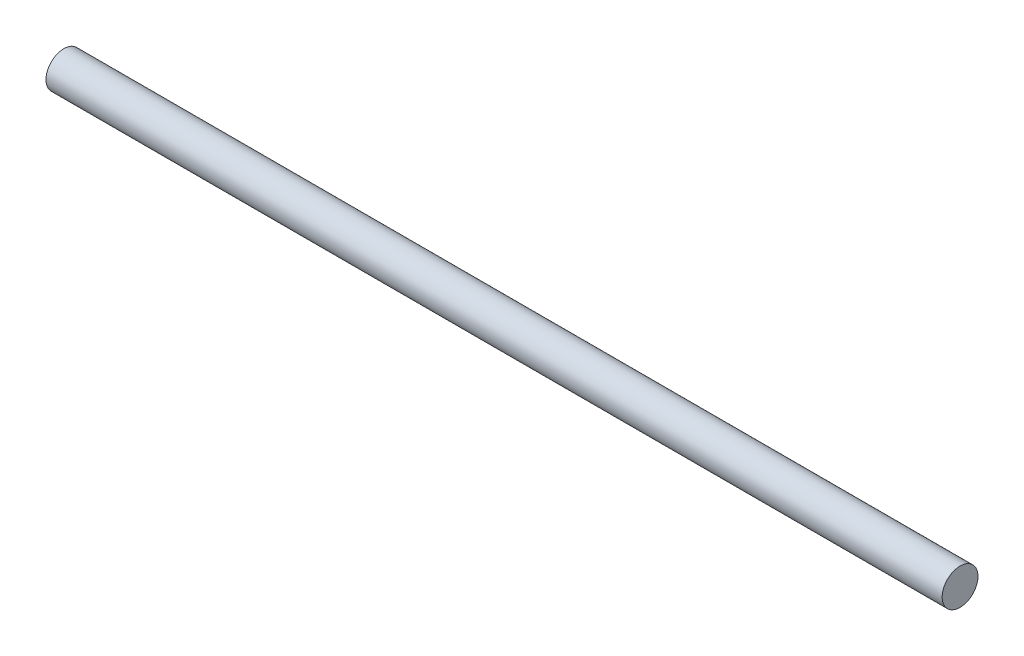
ISO-10303-21;
HEADER;
FILE_DESCRIPTION(('STEP AP214'),'2;1');
FILE_NAME('part.step','',(''),(''),'','','');
FILE_SCHEMA(('AUTOMOTIVE_DESIGN { 1 0 10303 214 1 1 1 1 }'));
ENDSEC;
DATA;
#1=APPLICATION_CONTEXT('core data for automotive mechanical design processes');
#2=APPLICATION_PROTOCOL_DEFINITION('international standard','automotive_design',2000,#1);
#3=PRODUCT_CONTEXT('',#1,'mechanical');
#4=PRODUCT('Part','Part','',(#3));
#5=PRODUCT_RELATED_PRODUCT_CATEGORY('part','',(#4));
#6=PRODUCT_DEFINITION_FORMATION('','',#4);
#7=PRODUCT_DEFINITION_CONTEXT('part definition',#1,'design');
#8=PRODUCT_DEFINITION('design','',#6,#7);
#9=PRODUCT_DEFINITION_SHAPE('','',#8);
#10=(LENGTH_UNIT() NAMED_UNIT(*) SI_UNIT(.MILLI.,.METRE.));
#11=(NAMED_UNIT(*) PLANE_ANGLE_UNIT() SI_UNIT($,.RADIAN.));
#12=(NAMED_UNIT(*) SI_UNIT($,.STERADIAN.) SOLID_ANGLE_UNIT());
#13=UNCERTAINTY_MEASURE_WITH_UNIT(LENGTH_MEASURE(1.E-05),#10,'distance_accuracy_value','');
#14=(GEOMETRIC_REPRESENTATION_CONTEXT(3) GLOBAL_UNCERTAINTY_ASSIGNED_CONTEXT((#13)) GLOBAL_UNIT_ASSIGNED_CONTEXT((#10,
#11,#12)) REPRESENTATION_CONTEXT('',''));
#15=CARTESIAN_POINT('',(0.,0.,0.));
#16=DIRECTION('',(0.,0.,1.));
#17=DIRECTION('',(1.,0.,0.));
#18=AXIS2_PLACEMENT_3D('',#15,#16,#17);
#19=CARTESIAN_POINT('',(200.,0.,0.));
#20=DIRECTION('',(-1.,0.,0.));
#21=DIRECTION('',(0.,0.,1.));
#22=AXIS2_PLACEMENT_3D('',#19,#20,#21);
#23=CYLINDRICAL_SURFACE('',#22,4.);
#24=CARTESIAN_POINT('',(200.,0.,0.));
#25=DIRECTION('',(1.,0.,0.));
#26=DIRECTION('',(0.,0.,-1.));
#27=AXIS2_PLACEMENT_3D('',#24,#25,#26);
#28=CIRCLE('',#27,4.);
#29=CARTESIAN_POINT('',(200.,0.,-4.));
#30=VERTEX_POINT('',#29);
#31=EDGE_CURVE('E10',#30,#30,#28,.T.);
#32=ORIENTED_EDGE('',*,*,#31,.F.);
#33=EDGE_LOOP('',(#32));
#34=FACE_BOUND('',#33,.T.);
#35=CARTESIAN_POINT('',(0.,0.,0.));
#36=DIRECTION('',(1.,0.,0.));
#37=DIRECTION('',(0.,0.,-1.));
#38=AXIS2_PLACEMENT_3D('',#35,#36,#37);
#39=CIRCLE('',#38,4.);
#40=CARTESIAN_POINT('',(0.,0.,-4.));
#41=VERTEX_POINT('',#40);
#42=EDGE_CURVE('E40',#41,#41,#39,.T.);
#43=ORIENTED_EDGE('',*,*,#42,.T.);
#44=EDGE_LOOP('',(#43));
#45=FACE_BOUND('',#44,.T.);
#46=ADVANCED_FACE('F37',(#34,#45),#23,.T.);
#47=CARTESIAN_POINT('',(200.,0.,0.));
#48=DIRECTION('',(1.,0.,0.));
#49=DIRECTION('',(0.,0.,-1.));
#50=AXIS2_PLACEMENT_3D('',#47,#48,#49);
#51=PLANE('',#50);
#52=ORIENTED_EDGE('',*,*,#31,.T.);
#53=EDGE_LOOP('',(#52));
#54=FACE_BOUND('',#53,.T.);
#55=ADVANCED_FACE('F54',(#54),#51,.T.);
#56=CARTESIAN_POINT('',(0.,0.,0.));
#57=DIRECTION('',(1.,0.,0.));
#58=DIRECTION('',(0.,0.,-1.));
#59=AXIS2_PLACEMENT_3D('',#56,#57,#58);
#60=PLANE('',#59);
#61=ORIENTED_EDGE('',*,*,#42,.F.);
#62=EDGE_LOOP('',(#61));
#63=FACE_BOUND('',#62,.T.);
#64=ADVANCED_FACE('F52',(#63),#60,.F.);
#65=CLOSED_SHELL('',(#46,#55,#64));
#66=MANIFOLD_SOLID_BREP('B2',#65);
#67=ADVANCED_BREP_SHAPE_REPRESENTATION('',(#18,#66),#14);
#68=SHAPE_DEFINITION_REPRESENTATION(#9,#67);
ENDSEC;
END-ISO-10303-21;
